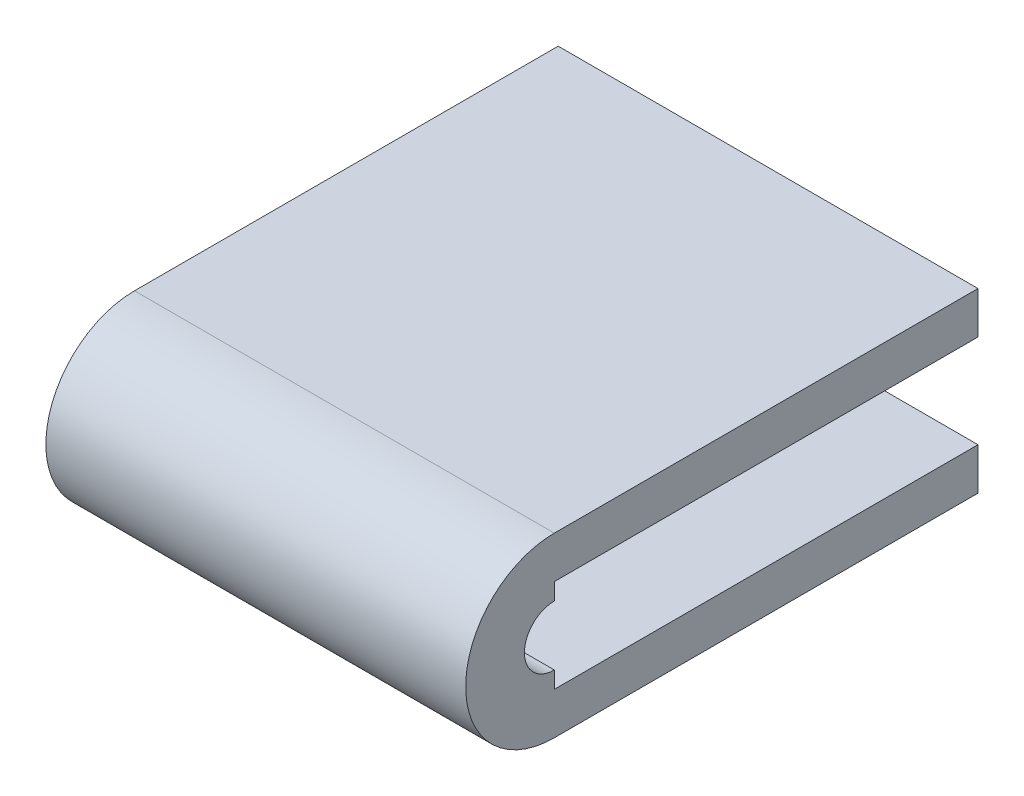
ISO-10303-21;
HEADER;
FILE_DESCRIPTION(('STEP AP214'),'2;1');
FILE_NAME('part.step','',(''),(''),'','','');
FILE_SCHEMA(('AUTOMOTIVE_DESIGN { 1 0 10303 214 1 1 1 1 }'));
ENDSEC;
DATA;
#1=APPLICATION_CONTEXT('core data for automotive mechanical design processes');
#2=APPLICATION_PROTOCOL_DEFINITION('international standard','automotive_design',2000,#1);
#3=PRODUCT_CONTEXT('',#1,'mechanical');
#4=PRODUCT('Part','Part','',(#3));
#5=PRODUCT_RELATED_PRODUCT_CATEGORY('part','',(#4));
#6=PRODUCT_DEFINITION_FORMATION('','',#4);
#7=PRODUCT_DEFINITION_CONTEXT('part definition',#1,'design');
#8=PRODUCT_DEFINITION('design','',#6,#7);
#9=PRODUCT_DEFINITION_SHAPE('','',#8);
#10=(LENGTH_UNIT() NAMED_UNIT(*) SI_UNIT(.MILLI.,.METRE.));
#11=(NAMED_UNIT(*) PLANE_ANGLE_UNIT() SI_UNIT($,.RADIAN.));
#12=(NAMED_UNIT(*) SI_UNIT($,.STERADIAN.) SOLID_ANGLE_UNIT());
#13=UNCERTAINTY_MEASURE_WITH_UNIT(LENGTH_MEASURE(1.E-05),#10,'distance_accuracy_value','');
#14=(GEOMETRIC_REPRESENTATION_CONTEXT(3) GLOBAL_UNCERTAINTY_ASSIGNED_CONTEXT((#13)) GLOBAL_UNIT_ASSIGNED_CONTEXT((#10,
#11,#12)) REPRESENTATION_CONTEXT('',''));
#15=CARTESIAN_POINT('',(0.,0.,0.));
#16=DIRECTION('',(0.,0.,1.));
#17=DIRECTION('',(1.,0.,0.));
#18=AXIS2_PLACEMENT_3D('',#15,#16,#17);
#19=CARTESIAN_POINT('',(28.575,6.0325,0.));
#20=DIRECTION('',(0.,1.,0.));
#21=DIRECTION('',(0.,0.,1.));
#22=AXIS2_PLACEMENT_3D('',#19,#20,#21);
#23=PLANE('',#22);
#24=DIRECTION('',(0.,0.,-1.));
#25=VECTOR('',#24,1.);
#26=CARTESIAN_POINT('',(0.,6.0325,0.));
#27=LINE('',#26,#25);
#28=CARTESIAN_POINT('',(0.,6.0325,0.));
#29=VERTEX_POINT('',#28);
#30=CARTESIAN_POINT('',(0.,6.0325,-28.8417));
#31=VERTEX_POINT('',#30);
#32=EDGE_CURVE('E148',#29,#31,#27,.T.);
#33=ORIENTED_EDGE('',*,*,#32,.F.);
#34=DIRECTION('',(-1.,0.,0.));
#35=VECTOR('',#34,1.);
#36=CARTESIAN_POINT('',(28.575,6.0325,0.));
#37=LINE('',#36,#35);
#38=CARTESIAN_POINT('',(28.575,6.0325,0.));
#39=VERTEX_POINT('',#38);
#40=EDGE_CURVE('E11',#39,#29,#37,.T.);
#41=ORIENTED_EDGE('',*,*,#40,.F.);
#42=DIRECTION('',(0.,0.,-1.));
#43=VECTOR('',#42,1.);
#44=CARTESIAN_POINT('',(28.575,6.0325,0.));
#45=LINE('',#44,#43);
#46=CARTESIAN_POINT('',(28.575,6.0325,-28.8417));
#47=VERTEX_POINT('',#46);
#48=EDGE_CURVE('E173',#39,#47,#45,.T.);
#49=ORIENTED_EDGE('',*,*,#48,.T.);
#50=DIRECTION('',(-1.,0.,0.));
#51=VECTOR('',#50,1.);
#52=CARTESIAN_POINT('',(28.575,6.0325,-28.8417));
#53=LINE('',#52,#51);
#54=EDGE_CURVE('E56',#47,#31,#53,.T.);
#55=ORIENTED_EDGE('',*,*,#54,.T.);
#56=EDGE_LOOP('',(#33,#41,#49,#55));
#57=FACE_BOUND('',#56,.T.);
#58=ADVANCED_FACE('F40',(#57),#23,.T.);
#59=CARTESIAN_POINT('',(28.575,0.,0.));
#60=DIRECTION('',(-1.,0.,0.));
#61=DIRECTION('',(0.,0.,1.));
#62=AXIS2_PLACEMENT_3D('',#59,#60,#61);
#63=CYLINDRICAL_SURFACE('',#62,6.0325);
#64=CARTESIAN_POINT('',(0.,0.,0.));
#65=DIRECTION('',(1.,0.,0.));
#66=DIRECTION('',(0.,0.,-1.));
#67=AXIS2_PLACEMENT_3D('',#64,#65,#66);
#68=CIRCLE('',#67,6.0325);
#69=CARTESIAN_POINT('',(0.,-6.0325,0.));
#70=VERTEX_POINT('',#69);
#71=EDGE_CURVE('E150',#29,#70,#68,.T.);
#72=ORIENTED_EDGE('',*,*,#71,.T.);
#73=DIRECTION('',(-1.,0.,0.));
#74=VECTOR('',#73,1.);
#75=CARTESIAN_POINT('',(28.575,-6.0325,0.));
#76=LINE('',#75,#74);
#77=CARTESIAN_POINT('',(28.575,-6.0325,0.));
#78=VERTEX_POINT('',#77);
#79=EDGE_CURVE('E48',#78,#70,#76,.T.);
#80=ORIENTED_EDGE('',*,*,#79,.F.);
#81=CARTESIAN_POINT('',(28.575,0.,0.));
#82=DIRECTION('',(1.,0.,0.));
#83=DIRECTION('',(0.,0.,-1.));
#84=AXIS2_PLACEMENT_3D('',#81,#82,#83);
#85=CIRCLE('',#84,6.0325);
#86=EDGE_CURVE('E208',#39,#78,#85,.T.);
#87=ORIENTED_EDGE('',*,*,#86,.F.);
#88=ORIENTED_EDGE('',*,*,#40,.T.);
#89=EDGE_LOOP('',(#72,#80,#87,#88));
#90=FACE_BOUND('',#89,.T.);
#91=ADVANCED_FACE('F229',(#90),#63,.T.);
#92=CARTESIAN_POINT('',(28.575,-6.0325,0.));
#93=DIRECTION('',(0.,1.,0.));
#94=DIRECTION('',(0.,0.,1.));
#95=AXIS2_PLACEMENT_3D('',#92,#93,#94);
#96=PLANE('',#95);
#97=DIRECTION('',(0.,0.,-1.));
#98=VECTOR('',#97,1.);
#99=CARTESIAN_POINT('',(0.,-6.0325,0.));
#100=LINE('',#99,#98);
#101=CARTESIAN_POINT('',(0.,-6.0325,-28.8417));
#102=VERTEX_POINT('',#101);
#103=EDGE_CURVE('E152',#70,#102,#100,.T.);
#104=ORIENTED_EDGE('',*,*,#103,.T.);
#105=DIRECTION('',(-1.,0.,0.));
#106=VECTOR('',#105,1.);
#107=CARTESIAN_POINT('',(28.575,-6.0325,-28.8417));
#108=LINE('',#107,#106);
#109=CARTESIAN_POINT('',(28.575,-6.0325,-28.8417));
#110=VERTEX_POINT('',#109);
#111=EDGE_CURVE('E183',#110,#102,#108,.T.);
#112=ORIENTED_EDGE('',*,*,#111,.F.);
#113=DIRECTION('',(0.,0.,-1.));
#114=VECTOR('',#113,1.);
#115=CARTESIAN_POINT('',(28.575,-6.0325,0.));
#116=LINE('',#115,#114);
#117=EDGE_CURVE('E191',#78,#110,#116,.T.);
#118=ORIENTED_EDGE('',*,*,#117,.F.);
#119=ORIENTED_EDGE('',*,*,#79,.T.);
#120=EDGE_LOOP('',(#104,#112,#118,#119));
#121=FACE_BOUND('',#120,.T.);
#122=ADVANCED_FACE('F189',(#121),#96,.F.);
#123=CARTESIAN_POINT('',(28.575,0.,-28.8417));
#124=DIRECTION('',(0.,0.,-1.));
#125=DIRECTION('',(-1.,0.,0.));
#126=AXIS2_PLACEMENT_3D('',#123,#124,#125);
#127=PLANE('',#126);
#128=DIRECTION('',(0.,-1.,0.));
#129=VECTOR('',#128,1.);
#130=CARTESIAN_POINT('',(0.,0.,-28.8417));
#131=LINE('',#130,#129);
#132=CARTESIAN_POINT('',(0.,-3.17499999999998,-28.8417));
#133=VERTEX_POINT('',#132);
#134=EDGE_CURVE('E155',#133,#102,#131,.T.);
#135=ORIENTED_EDGE('',*,*,#134,.F.);
#136=DIRECTION('',(-1.,0.,0.));
#137=VECTOR('',#136,1.);
#138=CARTESIAN_POINT('',(28.575,-3.17499999999998,-28.8417));
#139=LINE('',#138,#137);
#140=CARTESIAN_POINT('',(28.575,-3.17499999999998,-28.8417));
#141=VERTEX_POINT('',#140);
#142=EDGE_CURVE('E181',#141,#133,#139,.T.);
#143=ORIENTED_EDGE('',*,*,#142,.F.);
#144=DIRECTION('',(0.,-1.,0.));
#145=VECTOR('',#144,1.);
#146=CARTESIAN_POINT('',(28.575,0.,-28.8417));
#147=LINE('',#146,#145);
#148=EDGE_CURVE('E202',#141,#110,#147,.T.);
#149=ORIENTED_EDGE('',*,*,#148,.T.);
#150=ORIENTED_EDGE('',*,*,#111,.T.);
#151=EDGE_LOOP('',(#135,#143,#149,#150));
#152=FACE_BOUND('',#151,.T.);
#153=ADVANCED_FACE('F199',(#152),#127,.T.);
#154=CARTESIAN_POINT('',(28.575,-3.175,0.));
#155=DIRECTION('',(0.,1.,0.));
#156=DIRECTION('',(0.,0.,1.));
#157=AXIS2_PLACEMENT_3D('',#154,#155,#156);
#158=PLANE('',#157);
#159=DIRECTION('',(0.,0.,-1.));
#160=VECTOR('',#159,1.);
#161=CARTESIAN_POINT('',(0.,-3.175,0.));
#162=LINE('',#161,#160);
#163=CARTESIAN_POINT('',(0.,-3.175,0.));
#164=VERTEX_POINT('',#163);
#165=EDGE_CURVE('E158',#164,#133,#162,.T.);
#166=ORIENTED_EDGE('',*,*,#165,.F.);
#167=DIRECTION('',(-1.,0.,0.));
#168=VECTOR('',#167,1.);
#169=CARTESIAN_POINT('',(28.575,-3.175,0.));
#170=LINE('',#169,#168);
#171=CARTESIAN_POINT('',(28.575,-3.175,0.));
#172=VERTEX_POINT('',#171);
#173=EDGE_CURVE('E179',#172,#164,#170,.T.);
#174=ORIENTED_EDGE('',*,*,#173,.F.);
#175=DIRECTION('',(0.,0.,-1.));
#176=VECTOR('',#175,1.);
#177=CARTESIAN_POINT('',(28.575,-3.175,0.));
#178=LINE('',#177,#176);
#179=EDGE_CURVE('E205',#172,#141,#178,.T.);
#180=ORIENTED_EDGE('',*,*,#179,.T.);
#181=ORIENTED_EDGE('',*,*,#142,.T.);
#182=EDGE_LOOP('',(#166,#174,#180,#181));
#183=FACE_BOUND('',#182,.T.);
#184=ADVANCED_FACE('F240',(#183),#158,.T.);
#185=CARTESIAN_POINT('',(28.575,0.,0.));
#186=DIRECTION('',(0.,0.,-1.));
#187=DIRECTION('',(-1.,0.,0.));
#188=AXIS2_PLACEMENT_3D('',#185,#186,#187);
#189=PLANE('',#188);
#190=DIRECTION('',(0.,-1.,0.));
#191=VECTOR('',#190,1.);
#192=CARTESIAN_POINT('',(0.,0.,0.));
#193=LINE('',#192,#191);
#194=CARTESIAN_POINT('',(0.,-2.032,0.));
#195=VERTEX_POINT('',#194);
#196=EDGE_CURVE('E161',#195,#164,#193,.T.);
#197=ORIENTED_EDGE('',*,*,#196,.F.);
#198=DIRECTION('',(-1.,0.,0.));
#199=VECTOR('',#198,1.);
#200=CARTESIAN_POINT('',(28.575,-2.032,0.));
#201=LINE('',#200,#199);
#202=CARTESIAN_POINT('',(28.575,-2.032,0.));
#203=VERTEX_POINT('',#202);
#204=EDGE_CURVE('E177',#203,#195,#201,.T.);
#205=ORIENTED_EDGE('',*,*,#204,.F.);
#206=DIRECTION('',(0.,-1.,0.));
#207=VECTOR('',#206,1.);
#208=CARTESIAN_POINT('',(28.575,0.,0.));
#209=LINE('',#208,#207);
#210=EDGE_CURVE('E143',#203,#172,#209,.T.);
#211=ORIENTED_EDGE('',*,*,#210,.T.);
#212=ORIENTED_EDGE('',*,*,#173,.T.);
#213=EDGE_LOOP('',(#197,#205,#211,#212));
#214=FACE_BOUND('',#213,.T.);
#215=ADVANCED_FACE('F214',(#214),#189,.T.);
#216=CARTESIAN_POINT('',(28.575,0.,0.));
#217=DIRECTION('',(-1.,0.,0.));
#218=DIRECTION('',(0.,0.,1.));
#219=AXIS2_PLACEMENT_3D('',#216,#217,#218);
#220=CYLINDRICAL_SURFACE('',#219,2.032);
#221=CARTESIAN_POINT('',(0.,0.,0.));
#222=DIRECTION('',(1.,0.,0.));
#223=DIRECTION('',(0.,0.,-1.));
#224=AXIS2_PLACEMENT_3D('',#221,#222,#223);
#225=CIRCLE('',#224,2.032);
#226=CARTESIAN_POINT('',(0.,2.032,0.));
#227=VERTEX_POINT('',#226);
#228=EDGE_CURVE('E164',#227,#195,#225,.T.);
#229=ORIENTED_EDGE('',*,*,#228,.F.);
#230=DIRECTION('',(-1.,0.,0.));
#231=VECTOR('',#230,1.);
#232=CARTESIAN_POINT('',(28.575,2.032,0.));
#233=LINE('',#232,#231);
#234=CARTESIAN_POINT('',(28.575,2.032,0.));
#235=VERTEX_POINT('',#234);
#236=EDGE_CURVE('E128',#235,#227,#233,.T.);
#237=ORIENTED_EDGE('',*,*,#236,.F.);
#238=CARTESIAN_POINT('',(28.575,0.,0.));
#239=DIRECTION('',(1.,0.,0.));
#240=DIRECTION('',(0.,0.,-1.));
#241=AXIS2_PLACEMENT_3D('',#238,#239,#240);
#242=CIRCLE('',#241,2.032);
#243=EDGE_CURVE('E141',#235,#203,#242,.T.);
#244=ORIENTED_EDGE('',*,*,#243,.T.);
#245=ORIENTED_EDGE('',*,*,#204,.T.);
#246=EDGE_LOOP('',(#229,#237,#244,#245));
#247=FACE_BOUND('',#246,.T.);
#248=ADVANCED_FACE('F217',(#247),#220,.F.);
#249=CARTESIAN_POINT('',(28.575,0.,0.));
#250=DIRECTION('',(0.,0.,-1.));
#251=DIRECTION('',(-1.,0.,0.));
#252=AXIS2_PLACEMENT_3D('',#249,#250,#251);
#253=PLANE('',#252);
#254=DIRECTION('',(0.,-1.,0.));
#255=VECTOR('',#254,1.);
#256=CARTESIAN_POINT('',(0.,0.,0.));
#257=LINE('',#256,#255);
#258=CARTESIAN_POINT('',(0.,3.175,0.));
#259=VERTEX_POINT('',#258);
#260=EDGE_CURVE('E125',#259,#227,#257,.T.);
#261=ORIENTED_EDGE('',*,*,#260,.F.);
#262=DIRECTION('',(-1.,0.,0.));
#263=VECTOR('',#262,1.);
#264=CARTESIAN_POINT('',(28.575,3.175,0.));
#265=LINE('',#264,#263);
#266=CARTESIAN_POINT('',(28.575,3.175,0.));
#267=VERTEX_POINT('',#266);
#268=EDGE_CURVE('E119',#267,#259,#265,.T.);
#269=ORIENTED_EDGE('',*,*,#268,.F.);
#270=DIRECTION('',(0.,-1.,0.));
#271=VECTOR('',#270,1.);
#272=CARTESIAN_POINT('',(28.575,0.,0.));
#273=LINE('',#272,#271);
#274=EDGE_CURVE('E123',#267,#235,#273,.T.);
#275=ORIENTED_EDGE('',*,*,#274,.T.);
#276=ORIENTED_EDGE('',*,*,#236,.T.);
#277=EDGE_LOOP('',(#261,#269,#275,#276));
#278=FACE_BOUND('',#277,.T.);
#279=ADVANCED_FACE('F121',(#278),#253,.T.);
#280=CARTESIAN_POINT('',(28.575,3.175,0.));
#281=DIRECTION('',(0.,1.,0.));
#282=DIRECTION('',(0.,0.,1.));
#283=AXIS2_PLACEMENT_3D('',#280,#281,#282);
#284=PLANE('',#283);
#285=DIRECTION('',(0.,0.,-1.));
#286=VECTOR('',#285,1.);
#287=CARTESIAN_POINT('',(0.,3.175,0.));
#288=LINE('',#287,#286);
#289=CARTESIAN_POINT('',(0.,3.175,-28.8417));
#290=VERTEX_POINT('',#289);
#291=EDGE_CURVE('E168',#259,#290,#288,.T.);
#292=ORIENTED_EDGE('',*,*,#291,.T.);
#293=DIRECTION('',(-1.,0.,0.));
#294=VECTOR('',#293,1.);
#295=CARTESIAN_POINT('',(28.575,3.175,-28.8417));
#296=LINE('',#295,#294);
#297=CARTESIAN_POINT('',(28.575,3.175,-28.8417));
#298=VERTEX_POINT('',#297);
#299=EDGE_CURVE('E88',#298,#290,#296,.T.);
#300=ORIENTED_EDGE('',*,*,#299,.F.);
#301=DIRECTION('',(0.,0.,-1.));
#302=VECTOR('',#301,1.);
#303=CARTESIAN_POINT('',(28.575,3.175,0.));
#304=LINE('',#303,#302);
#305=EDGE_CURVE('E130',#267,#298,#304,.T.);
#306=ORIENTED_EDGE('',*,*,#305,.F.);
#307=ORIENTED_EDGE('',*,*,#268,.T.);
#308=EDGE_LOOP('',(#292,#300,#306,#307));
#309=FACE_BOUND('',#308,.T.);
#310=ADVANCED_FACE('F131',(#309),#284,.F.);
#311=CARTESIAN_POINT('',(28.575,0.,-28.8417));
#312=DIRECTION('',(0.,0.,-1.));
#313=DIRECTION('',(0.,1.,0.));
#314=AXIS2_PLACEMENT_3D('',#311,#312,#313);
#315=PLANE('',#314);
#316=DIRECTION('',(0.,-1.,0.));
#317=VECTOR('',#316,1.);
#318=CARTESIAN_POINT('',(0.,0.,-28.8417));
#319=LINE('',#318,#317);
#320=EDGE_CURVE('E170',#31,#290,#319,.T.);
#321=ORIENTED_EDGE('',*,*,#320,.F.);
#322=ORIENTED_EDGE('',*,*,#54,.F.);
#323=DIRECTION('',(0.,-1.,0.));
#324=VECTOR('',#323,1.);
#325=CARTESIAN_POINT('',(28.575,0.,-28.8417));
#326=LINE('',#325,#324);
#327=EDGE_CURVE('E134',#47,#298,#326,.T.);
#328=ORIENTED_EDGE('',*,*,#327,.T.);
#329=ORIENTED_EDGE('',*,*,#299,.T.);
#330=EDGE_LOOP('',(#321,#322,#328,#329));
#331=FACE_BOUND('',#330,.T.);
#332=ADVANCED_FACE('F218',(#331),#315,.T.);
#333=CARTESIAN_POINT('',(28.575,0.,0.));
#334=DIRECTION('',(1.,0.,0.));
#335=DIRECTION('',(0.,0.,-1.));
#336=AXIS2_PLACEMENT_3D('',#333,#334,#335);
#337=PLANE('',#336);
#338=ORIENTED_EDGE('',*,*,#48,.F.);
#339=ORIENTED_EDGE('',*,*,#86,.T.);
#340=ORIENTED_EDGE('',*,*,#117,.T.);
#341=ORIENTED_EDGE('',*,*,#148,.F.);
#342=ORIENTED_EDGE('',*,*,#179,.F.);
#343=ORIENTED_EDGE('',*,*,#210,.F.);
#344=ORIENTED_EDGE('',*,*,#243,.F.);
#345=ORIENTED_EDGE('',*,*,#274,.F.);
#346=ORIENTED_EDGE('',*,*,#305,.T.);
#347=ORIENTED_EDGE('',*,*,#327,.F.);
#348=EDGE_LOOP('',(#338,#339,#340,#341,#342,#343,#344,#345,#346,#347));
#349=FACE_BOUND('',#348,.T.);
#350=ADVANCED_FACE('F138',(#349),#337,.T.);
#351=CARTESIAN_POINT('',(0.,0.,0.));
#352=DIRECTION('',(1.,0.,0.));
#353=DIRECTION('',(0.,0.,-1.));
#354=AXIS2_PLACEMENT_3D('',#351,#352,#353);
#355=PLANE('',#354);
#356=ORIENTED_EDGE('',*,*,#32,.T.);
#357=ORIENTED_EDGE('',*,*,#320,.T.);
#358=ORIENTED_EDGE('',*,*,#291,.F.);
#359=ORIENTED_EDGE('',*,*,#260,.T.);
#360=ORIENTED_EDGE('',*,*,#228,.T.);
#361=ORIENTED_EDGE('',*,*,#196,.T.);
#362=ORIENTED_EDGE('',*,*,#165,.T.);
#363=ORIENTED_EDGE('',*,*,#134,.T.);
#364=ORIENTED_EDGE('',*,*,#103,.F.);
#365=ORIENTED_EDGE('',*,*,#71,.F.);
#366=EDGE_LOOP('',(#356,#357,#358,#359,#360,#361,#362,#363,#364,#365));
#367=FACE_BOUND('',#366,.T.);
#368=ADVANCED_FACE('F195',(#367),#355,.F.);
#369=CLOSED_SHELL('',(#58,#91,#122,#153,#184,#215,#248,#279,#310,#332,#350,#368));
#370=MANIFOLD_SOLID_BREP('B2',#369);
#371=ADVANCED_BREP_SHAPE_REPRESENTATION('',(#18,#370),#14);
#372=SHAPE_DEFINITION_REPRESENTATION(#9,#371);
ENDSEC;
END-ISO-10303-21;
